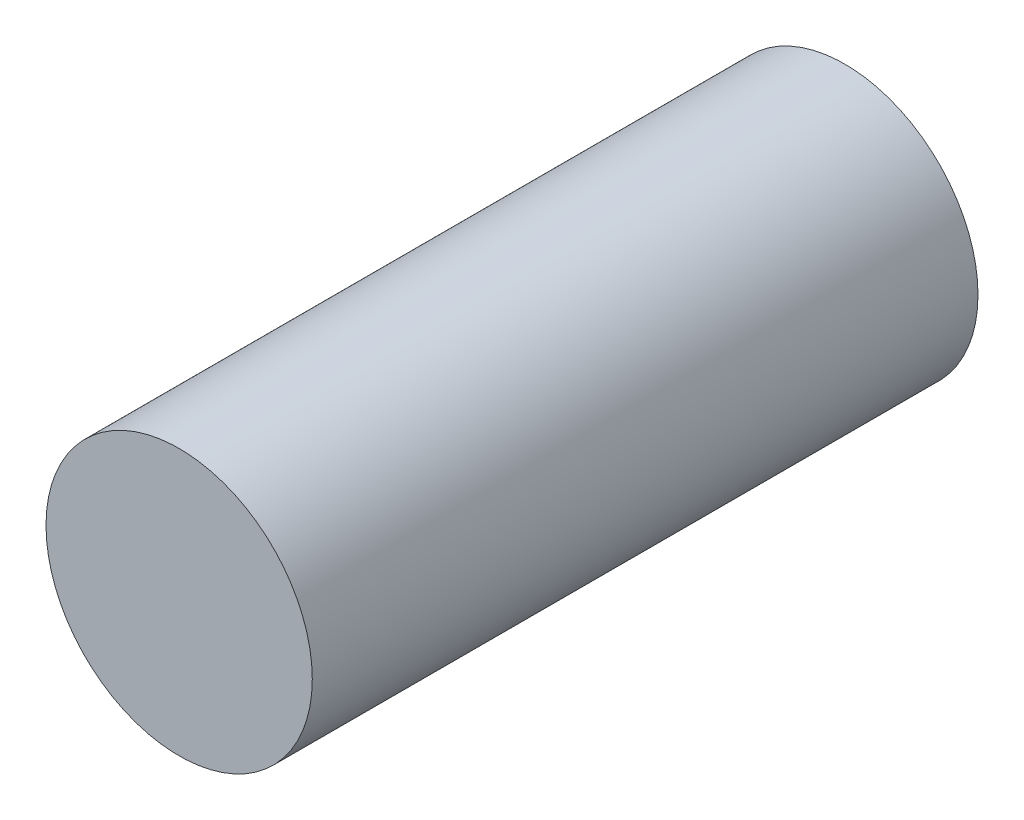
ISO-10303-21;
HEADER;
FILE_DESCRIPTION(('STEP AP214'),'2;1');
FILE_NAME('part.step','',(''),(''),'','','');
FILE_SCHEMA(('AUTOMOTIVE_DESIGN { 1 0 10303 214 1 1 1 1 }'));
ENDSEC;
DATA;
#1=APPLICATION_CONTEXT('core data for automotive mechanical design processes');
#2=APPLICATION_PROTOCOL_DEFINITION('international standard','automotive_design',2000,#1);
#3=PRODUCT_CONTEXT('',#1,'mechanical');
#4=PRODUCT('Part','Part','',(#3));
#5=PRODUCT_RELATED_PRODUCT_CATEGORY('part','',(#4));
#6=PRODUCT_DEFINITION_FORMATION('','',#4);
#7=PRODUCT_DEFINITION_CONTEXT('part definition',#1,'design');
#8=PRODUCT_DEFINITION('design','',#6,#7);
#9=PRODUCT_DEFINITION_SHAPE('','',#8);
#10=(LENGTH_UNIT() NAMED_UNIT(*) SI_UNIT(.MILLI.,.METRE.));
#11=(NAMED_UNIT(*) PLANE_ANGLE_UNIT() SI_UNIT($,.RADIAN.));
#12=(NAMED_UNIT(*) SI_UNIT($,.STERADIAN.) SOLID_ANGLE_UNIT());
#13=UNCERTAINTY_MEASURE_WITH_UNIT(LENGTH_MEASURE(1.E-05),#10,'distance_accuracy_value','');
#14=(GEOMETRIC_REPRESENTATION_CONTEXT(3) GLOBAL_UNCERTAINTY_ASSIGNED_CONTEXT((#13)) GLOBAL_UNIT_ASSIGNED_CONTEXT((#10,
#11,#12)) REPRESENTATION_CONTEXT('',''));
#15=CARTESIAN_POINT('',(0.,0.,0.));
#16=DIRECTION('',(0.,0.,1.));
#17=DIRECTION('',(1.,0.,0.));
#18=AXIS2_PLACEMENT_3D('',#15,#16,#17);
#19=CARTESIAN_POINT('',(0.,0.,-127.));
#20=DIRECTION('',(0.,0.,1.));
#21=DIRECTION('',(1.,0.,0.));
#22=AXIS2_PLACEMENT_3D('',#19,#20,#21);
#23=CYLINDRICAL_SURFACE('',#22,25.4);
#24=CARTESIAN_POINT('',(0.,0.,-127.));
#25=DIRECTION('',(0.,0.,1.));
#26=DIRECTION('',(1.,0.,0.));
#27=AXIS2_PLACEMENT_3D('',#24,#25,#26);
#28=CIRCLE('',#27,25.4);
#29=CARTESIAN_POINT('',(25.4,0.,-127.));
#30=VERTEX_POINT('',#29);
#31=EDGE_CURVE('E10',#30,#30,#28,.T.);
#32=ORIENTED_EDGE('',*,*,#31,.T.);
#33=EDGE_LOOP('',(#32));
#34=FACE_BOUND('',#33,.T.);
#35=CARTESIAN_POINT('',(0.,0.,0.));
#36=DIRECTION('',(0.,0.,1.));
#37=DIRECTION('',(1.,0.,0.));
#38=AXIS2_PLACEMENT_3D('',#35,#36,#37);
#39=CIRCLE('',#38,25.4);
#40=CARTESIAN_POINT('',(25.4,0.,0.));
#41=VERTEX_POINT('',#40);
#42=EDGE_CURVE('E33',#41,#41,#39,.T.);
#43=ORIENTED_EDGE('',*,*,#42,.F.);
#44=EDGE_LOOP('',(#43));
#45=FACE_BOUND('',#44,.T.);
#46=ADVANCED_FACE('F30',(#34,#45),#23,.T.);
#47=CARTESIAN_POINT('',(0.,0.,-127.));
#48=DIRECTION('',(0.,0.,1.));
#49=DIRECTION('',(1.,0.,0.));
#50=AXIS2_PLACEMENT_3D('',#47,#48,#49);
#51=PLANE('',#50);
#52=ORIENTED_EDGE('',*,*,#31,.F.);
#53=EDGE_LOOP('',(#52));
#54=FACE_BOUND('',#53,.T.);
#55=ADVANCED_FACE('F45',(#54),#51,.F.);
#56=CARTESIAN_POINT('',(0.,0.,0.));
#57=DIRECTION('',(0.,0.,1.));
#58=DIRECTION('',(1.,0.,0.));
#59=AXIS2_PLACEMENT_3D('',#56,#57,#58);
#60=PLANE('',#59);
#61=ORIENTED_EDGE('',*,*,#42,.T.);
#62=EDGE_LOOP('',(#61));
#63=FACE_BOUND('',#62,.T.);
#64=ADVANCED_FACE('F42',(#63),#60,.T.);
#65=CLOSED_SHELL('',(#46,#55,#64));
#66=MANIFOLD_SOLID_BREP('B2',#65);
#67=ADVANCED_BREP_SHAPE_REPRESENTATION('',(#18,#66),#14);
#68=SHAPE_DEFINITION_REPRESENTATION(#9,#67);
ENDSEC;
END-ISO-10303-21;
